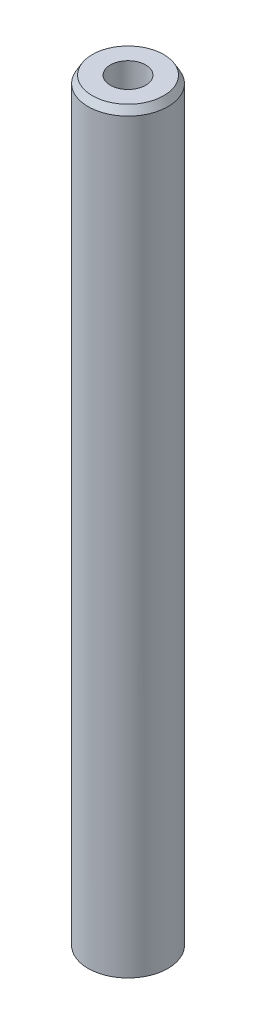
ISO-10303-21;
HEADER;
FILE_DESCRIPTION(('STEP AP214'),'2;1');
FILE_NAME('part.step','',(''),(''),'','','');
FILE_SCHEMA(('AUTOMOTIVE_DESIGN { 1 0 10303 214 1 1 1 1 }'));
ENDSEC;
DATA;
#1=APPLICATION_CONTEXT('core data for automotive mechanical design processes');
#2=APPLICATION_PROTOCOL_DEFINITION('international standard','automotive_design',2000,#1);
#3=PRODUCT_CONTEXT('',#1,'mechanical');
#4=PRODUCT('Part','Part','',(#3));
#5=PRODUCT_RELATED_PRODUCT_CATEGORY('part','',(#4));
#6=PRODUCT_DEFINITION_FORMATION('','',#4);
#7=PRODUCT_DEFINITION_CONTEXT('part definition',#1,'design');
#8=PRODUCT_DEFINITION('design','',#6,#7);
#9=PRODUCT_DEFINITION_SHAPE('','',#8);
#10=(LENGTH_UNIT() NAMED_UNIT(*) SI_UNIT(.MILLI.,.METRE.));
#11=(NAMED_UNIT(*) PLANE_ANGLE_UNIT() SI_UNIT($,.RADIAN.));
#12=(NAMED_UNIT(*) SI_UNIT($,.STERADIAN.) SOLID_ANGLE_UNIT());
#13=UNCERTAINTY_MEASURE_WITH_UNIT(LENGTH_MEASURE(1.E-05),#10,'distance_accuracy_value','');
#14=(GEOMETRIC_REPRESENTATION_CONTEXT(3) GLOBAL_UNCERTAINTY_ASSIGNED_CONTEXT((#13)) GLOBAL_UNIT_ASSIGNED_CONTEXT((#10,
#11,#12)) REPRESENTATION_CONTEXT('',''));
#15=CARTESIAN_POINT('',(0.,0.,0.));
#16=DIRECTION('',(0.,0.,1.));
#17=DIRECTION('',(1.,0.,0.));
#18=AXIS2_PLACEMENT_3D('',#15,#16,#17);
#19=CARTESIAN_POINT('',(0.,474.528961845361,0.));
#20=DIRECTION('',(0.,-1.,0.));
#21=DIRECTION('',(0.,0.,-1.));
#22=AXIS2_PLACEMENT_3D('',#19,#20,#21);
#23=CYLINDRICAL_SURFACE('',#22,25.);
#24=CARTESIAN_POINT('',(0.,469.940287859123,0.));
#25=DIRECTION('',(0.,1.,0.));
#26=DIRECTION('',(0.,0.,1.));
#27=AXIS2_PLACEMENT_3D('',#24,#25,#26);
#28=CIRCLE('',#27,25.);
#29=CARTESIAN_POINT('',(0.,469.940287859123,-25.));
#30=VERTEX_POINT('',#29);
#31=EDGE_CURVE('E50',#30,#30,#28,.F.);
#32=CARTESIAN_POINT('',(0.,2.64927216117855,0.));
#33=DIRECTION('',(0.,1.,0.));
#34=DIRECTION('',(0.,0.,1.));
#35=AXIS2_PLACEMENT_3D('',#32,#33,#34);
#36=CIRCLE('',#35,25.);
#37=CARTESIAN_POINT('',(0.,2.64927216117855,-25.));
#38=VERTEX_POINT('',#37);
#39=EDGE_CURVE('E51',#38,#38,#36,.T.);
#40=CARTESIAN_POINT('',(0.,469.940287859123,-25.));
#41=CARTESIAN_POINT('',(0.,465.072673112269,-25.));
#42=CARTESIAN_POINT('',(0.,460.205058365416,-25.));
#43=CARTESIAN_POINT('',(0.,450.469828871709,-25.));
#44=CARTESIAN_POINT('',(0.,445.602214124855,-25.));
#45=CARTESIAN_POINT('',(0.,435.866984631148,-25.));
#46=CARTESIAN_POINT('',(0.,430.999369884294,-25.));
#47=CARTESIAN_POINT('',(0.,421.264140390587,-25.));
#48=CARTESIAN_POINT('',(0.,416.396525643734,-25.));
#49=CARTESIAN_POINT('',(0.,406.661296150026,-25.));
#50=CARTESIAN_POINT('',(0.,401.793681403173,-25.));
#51=CARTESIAN_POINT('',(0.,392.058451909466,-25.));
#52=CARTESIAN_POINT('',(0.,387.190837162612,-25.));
#53=CARTESIAN_POINT('',(0.,377.455607668905,-25.));
#54=CARTESIAN_POINT('',(0.,372.587992922051,-25.));
#55=CARTESIAN_POINT('',(0.,362.852763428344,-25.));
#56=CARTESIAN_POINT('',(0.,357.985148681491,-25.));
#57=CARTESIAN_POINT('',(0.,348.249919187783,-25.));
#58=CARTESIAN_POINT('',(0.,343.38230444093,-25.));
#59=CARTESIAN_POINT('',(0.,333.647074947223,-25.));
#60=CARTESIAN_POINT('',(0.,328.779460200369,-25.));
#61=CARTESIAN_POINT('',(0.,319.044230706662,-25.));
#62=CARTESIAN_POINT('',(0.,314.176615959808,-25.));
#63=CARTESIAN_POINT('',(0.,304.441386466101,-25.));
#64=CARTESIAN_POINT('',(0.,299.573771719247,-25.));
#65=CARTESIAN_POINT('',(0.,289.83854222554,-25.));
#66=CARTESIAN_POINT('',(0.,284.970927478687,-25.));
#67=CARTESIAN_POINT('',(0.,275.235697984979,-25.));
#68=CARTESIAN_POINT('',(0.,270.368083238126,-25.));
#69=CARTESIAN_POINT('',(0.,260.632853744419,-25.));
#70=CARTESIAN_POINT('',(0.,255.765238997565,-25.));
#71=CARTESIAN_POINT('',(0.,246.030009503858,-25.));
#72=CARTESIAN_POINT('',(0.,241.162394757004,-25.));
#73=CARTESIAN_POINT('',(0.,231.427165263297,-25.));
#74=CARTESIAN_POINT('',(0.,226.559550516444,-25.));
#75=CARTESIAN_POINT('',(0.,216.824321022736,-25.));
#76=CARTESIAN_POINT('',(0.,211.956706275883,-25.));
#77=CARTESIAN_POINT('',(0.,202.221476782176,-25.));
#78=CARTESIAN_POINT('',(0.,197.353862035322,-25.));
#79=CARTESIAN_POINT('',(0.,187.618632541615,-25.));
#80=CARTESIAN_POINT('',(0.,182.751017794761,-25.));
#81=CARTESIAN_POINT('',(0.,173.015788301054,-25.));
#82=CARTESIAN_POINT('',(0.,168.148173554201,-25.));
#83=CARTESIAN_POINT('',(0.,158.412944060493,-25.));
#84=CARTESIAN_POINT('',(0.,153.54532931364,-25.));
#85=CARTESIAN_POINT('',(0.,143.810099819933,-25.));
#86=CARTESIAN_POINT('',(0.,138.942485073079,-25.));
#87=CARTESIAN_POINT('',(0.,129.207255579372,-25.));
#88=CARTESIAN_POINT('',(0.,124.339640832518,-25.));
#89=CARTESIAN_POINT('',(0.,114.604411338811,-25.));
#90=CARTESIAN_POINT('',(0.,109.736796591958,-25.));
#91=CARTESIAN_POINT('',(0.,100.00156709825,-25.));
#92=CARTESIAN_POINT('',(0.,95.1339523513968,-25.));
#93=CARTESIAN_POINT('',(0.,85.3987228576896,-25.));
#94=CARTESIAN_POINT('',(0.,80.531108110836,-25.));
#95=CARTESIAN_POINT('',(0.,70.7958786171288,-25.));
#96=CARTESIAN_POINT('',(0.,65.9282638702752,-25.));
#97=CARTESIAN_POINT('',(0.,56.193034376568,-25.));
#98=CARTESIAN_POINT('',(0.,51.3254196297144,-25.));
#99=CARTESIAN_POINT('',(0.,41.5901901360073,-25.));
#100=CARTESIAN_POINT('',(0.,36.7225753891537,-25.));
#101=CARTESIAN_POINT('',(0.,26.9873458954465,-25.));
#102=CARTESIAN_POINT('',(0.,22.1197311485929,-25.));
#103=CARTESIAN_POINT('',(0.,12.3845016548857,-25.));
#104=CARTESIAN_POINT('',(0.,7.51688690803215,-25.));
#105=CARTESIAN_POINT('',(0.,2.64927216117855,-25.));
#106=B_SPLINE_CURVE_WITH_KNOTS('',3,(#40,#41,#42,#43,#44,#45,#46,#47,#48,#49,#50,#51,#52,#53,
#54,#55,#56,#57,#58,#59,#60,#61,#62,#63,#64,#65,#66,#67,#68,#69,#70,#71,#72,#73,#74,#75,#76,#77,
#78,#79,#80,#81,#82,#83,#84,#85,#86,#87,#88,#89,#90,#91,#92,#93,#94,#95,#96,#97,#98,#99,#100,
#101,#102,#103,#104,#105),.UNSPECIFIED.,.F.,.F.,(4,2,2,2,2,2,2,2,2,2,2,2,2,2,2,2,2,2,2,2,2,2,2,
2,2,2,2,2,2,2,2,2,4),(0.,14.6028442405608,29.2056884811215,43.8085327216823,58.4113769622431,
73.0142212028038,87.6170654433646,102.219909683925,116.822753924486,131.425598165047,
146.028442405608,160.631286646168,175.234130886729,189.83697512729,204.439819367851,
219.042663608411,233.645507848972,248.248352089533,262.851196330094,277.454040570654,
292.056884811215,306.659729051776,321.262573292337,335.865417532898,350.468261773458,
365.071106014019,379.67395025458,394.276794495141,408.879638735701,423.482482976262,
438.085327216823,452.688171457384,467.291015697944),.UNSPECIFIED.);
#107=EDGE_CURVE('BSEAM39',#30,#38,#106,.T.);
#108=ORIENTED_EDGE('',*,*,#31,.T.);
#109=ORIENTED_EDGE('',*,*,#39,.T.);
#110=ORIENTED_EDGE('',*,*,#107,.T.);
#111=ORIENTED_EDGE('',*,*,#107,.F.);
#112=EDGE_LOOP('',(#108,#110,#109,#111));
#113=FACE_BOUND('',#112,.T.);
#114=ADVANCED_FACE('F39',(#113),#23,.T.);
#115=CARTESIAN_POINT('',(0.,474.528961845361,0.));
#116=DIRECTION('',(0.,1.,0.));
#117=DIRECTION('',(0.,0.,1.));
#118=AXIS2_PLACEMENT_3D('',#115,#116,#117);
#119=PLANE('',#118);
#120=CARTESIAN_POINT('',(0.,474.528961845361,0.));
#121=DIRECTION('',(0.,1.,0.));
#122=DIRECTION('',(0.,0.,1.));
#123=AXIS2_PLACEMENT_3D('',#120,#121,#122);
#124=CIRCLE('',#123,22.3507278388219);
#125=CARTESIAN_POINT('',(0.,474.528961845361,22.3507278388219));
#126=VERTEX_POINT('',#125);
#127=EDGE_CURVE('E54',#126,#126,#124,.T.);
#128=ORIENTED_EDGE('',*,*,#127,.T.);
#129=EDGE_LOOP('',(#128));
#130=FACE_BOUND('',#129,.T.);
#131=CARTESIAN_POINT('',(0.,474.528961845361,0.));
#132=DIRECTION('',(0.,1.,0.));
#133=DIRECTION('',(0.,0.,1.));
#134=AXIS2_PLACEMENT_3D('',#131,#132,#133);
#135=CIRCLE('',#134,11.0522564921189);
#136=CARTESIAN_POINT('',(0.,474.528961845361,-11.0522564921189));
#137=VERTEX_POINT('',#136);
#138=EDGE_CURVE('E58',#137,#137,#135,.T.);
#139=ORIENTED_EDGE('',*,*,#138,.F.);
#140=EDGE_LOOP('',(#139));
#141=FACE_BOUND('',#140,.T.);
#142=ADVANCED_FACE('F69',(#130,#141),#119,.T.);
#143=CARTESIAN_POINT('',(0.,0.,0.));
#144=DIRECTION('',(0.,1.,0.));
#145=DIRECTION('',(0.,0.,1.));
#146=AXIS2_PLACEMENT_3D('',#143,#144,#145);
#147=PLANE('',#146);
#148=CARTESIAN_POINT('',(0.,0.,0.));
#149=DIRECTION('',(0.,1.,0.));
#150=DIRECTION('',(0.,0.,1.));
#151=AXIS2_PLACEMENT_3D('',#148,#149,#150);
#152=CIRCLE('',#151,20.4113260137609);
#153=CARTESIAN_POINT('',(0.,0.,20.4113260137609));
#154=VERTEX_POINT('',#153);
#155=EDGE_CURVE('E10',#154,#154,#152,.F.);
#156=ORIENTED_EDGE('',*,*,#155,.T.);
#157=EDGE_LOOP('',(#156));
#158=FACE_BOUND('',#157,.T.);
#159=CARTESIAN_POINT('',(0.,0.,0.));
#160=DIRECTION('',(0.,1.,0.));
#161=DIRECTION('',(0.,0.,1.));
#162=AXIS2_PLACEMENT_3D('',#159,#160,#161);
#163=CIRCLE('',#162,11.0522564921189);
#164=CARTESIAN_POINT('',(0.,0.,-11.0522564921189));
#165=VERTEX_POINT('',#164);
#166=EDGE_CURVE('E63',#165,#165,#163,.T.);
#167=ORIENTED_EDGE('',*,*,#166,.T.);
#168=EDGE_LOOP('',(#167));
#169=FACE_BOUND('',#168,.T.);
#170=ADVANCED_FACE('F75',(#158,#169),#147,.F.);
#171=CARTESIAN_POINT('',(0.,474.528961845361,0.));
#172=DIRECTION('',(0.,-1.,0.));
#173=DIRECTION('',(0.,0.,-1.));
#174=AXIS2_PLACEMENT_3D('',#171,#172,#173);
#175=CYLINDRICAL_SURFACE('',#174,11.0522564921189);
#176=CARTESIAN_POINT('',(0.,474.528961845361,-11.0522564921189));
#177=CARTESIAN_POINT('',(0.,469.585951826139,-11.0522564921189));
#178=CARTESIAN_POINT('',(0.,464.642941806916,-11.0522564921189));
#179=CARTESIAN_POINT('',(0.,454.756921768471,-11.0522564921189));
#180=CARTESIAN_POINT('',(0.,449.813911749249,-11.0522564921189));
#181=CARTESIAN_POINT('',(0.,439.927891710804,-11.0522564921189));
#182=CARTESIAN_POINT('',(0.,434.984881691581,-11.0522564921189));
#183=CARTESIAN_POINT('',(0.,425.098861653136,-11.0522564921189));
#184=CARTESIAN_POINT('',(0.,420.155851633914,-11.0522564921189));
#185=CARTESIAN_POINT('',(0.,410.269831595469,-11.0522564921189));
#186=CARTESIAN_POINT('',(0.,405.326821576246,-11.0522564921189));
#187=CARTESIAN_POINT('',(0.,395.440801537801,-11.0522564921189));
#188=CARTESIAN_POINT('',(0.,390.497791518579,-11.0522564921189));
#189=CARTESIAN_POINT('',(0.,380.611771480134,-11.0522564921189));
#190=CARTESIAN_POINT('',(0.,375.668761460911,-11.0522564921189));
#191=CARTESIAN_POINT('',(0.,365.782741422466,-11.0522564921189));
#192=CARTESIAN_POINT('',(0.,360.839731403243,-11.0522564921189));
#193=CARTESIAN_POINT('',(0.,350.953711364798,-11.0522564921189));
#194=CARTESIAN_POINT('',(0.,346.010701345576,-11.0522564921189));
#195=CARTESIAN_POINT('',(0.,336.124681307131,-11.0522564921189));
#196=CARTESIAN_POINT('',(0.,331.181671287908,-11.0522564921189));
#197=CARTESIAN_POINT('',(0.,321.295651249463,-11.0522564921189));
#198=CARTESIAN_POINT('',(0.,316.352641230241,-11.0522564921189));
#199=CARTESIAN_POINT('',(0.,306.466621191796,-11.0522564921189));
#200=CARTESIAN_POINT('',(0.,301.523611172573,-11.0522564921189));
#201=CARTESIAN_POINT('',(0.,291.637591134128,-11.0522564921189));
#202=CARTESIAN_POINT('',(0.,286.694581114906,-11.0522564921189));
#203=CARTESIAN_POINT('',(0.,276.808561076461,-11.0522564921189));
#204=CARTESIAN_POINT('',(0.,271.865551057238,-11.0522564921189));
#205=CARTESIAN_POINT('',(0.,261.979531018793,-11.0522564921189));
#206=CARTESIAN_POINT('',(0.,257.036520999571,-11.0522564921189));
#207=CARTESIAN_POINT('',(0.,247.150500961126,-11.0522564921189));
#208=CARTESIAN_POINT('',(0.,242.207490941903,-11.0522564921189));
#209=CARTESIAN_POINT('',(0.,232.321470903458,-11.0522564921189));
#210=CARTESIAN_POINT('',(0.,227.378460884236,-11.0522564921189));
#211=CARTESIAN_POINT('',(0.,217.492440845791,-11.0522564921189));
#212=CARTESIAN_POINT('',(0.,212.549430826568,-11.0522564921189));
#213=CARTESIAN_POINT('',(0.,202.663410788123,-11.0522564921189));
#214=CARTESIAN_POINT('',(0.,197.720400768901,-11.0522564921189));
#215=CARTESIAN_POINT('',(0.,187.834380730456,-11.0522564921189));
#216=CARTESIAN_POINT('',(0.,182.891370711233,-11.0522564921189));
#217=CARTESIAN_POINT('',(0.,173.005350672788,-11.0522564921189));
#218=CARTESIAN_POINT('',(0.,168.062340653565,-11.0522564921189));
#219=CARTESIAN_POINT('',(0.,158.17632061512,-11.0522564921189));
#220=CARTESIAN_POINT('',(0.,153.233310595898,-11.0522564921189));
#221=CARTESIAN_POINT('',(0.,143.347290557453,-11.0522564921189));
#222=CARTESIAN_POINT('',(0.,138.40428053823,-11.0522564921189));
#223=CARTESIAN_POINT('',(0.,128.518260499785,-11.0522564921189));
#224=CARTESIAN_POINT('',(0.,123.575250480563,-11.0522564921189));
#225=CARTESIAN_POINT('',(0.,113.689230442118,-11.0522564921189));
#226=CARTESIAN_POINT('',(0.,108.746220422895,-11.0522564921189));
#227=CARTESIAN_POINT('',(0.,98.8602003844502,-11.0522564921189));
#228=CARTESIAN_POINT('',(0.,93.9171903652277,-11.0522564921189));
#229=CARTESIAN_POINT('',(0.,84.0311703267827,-11.0522564921189));
#230=CARTESIAN_POINT('',(0.,79.0881603075602,-11.0522564921189));
#231=CARTESIAN_POINT('',(0.,69.2021402691152,-11.0522564921189));
#232=CARTESIAN_POINT('',(0.,64.2591302498926,-11.0522564921189));
#233=CARTESIAN_POINT('',(0.,54.3731102114476,-11.0522564921189));
#234=CARTESIAN_POINT('',(0.,49.4301001922251,-11.0522564921189));
#235=CARTESIAN_POINT('',(0.,39.5440801537801,-11.0522564921189));
#236=CARTESIAN_POINT('',(0.,34.6010701345576,-11.0522564921189));
#237=CARTESIAN_POINT('',(0.,24.7150500961125,-11.0522564921189));
#238=CARTESIAN_POINT('',(0.,19.77204007689,-11.0522564921189));
#239=CARTESIAN_POINT('',(0.,9.88602003844499,-11.0522564921189));
#240=CARTESIAN_POINT('',(0.,4.94301001922247,-11.0522564921189));
#241=CARTESIAN_POINT('',(0.,0.,-11.0522564921189));
#242=B_SPLINE_CURVE_WITH_KNOTS('',3,(#176,#177,#178,#179,#180,#181,#182,#183,#184,#185,#186,
#187,#188,#189,#190,#191,#192,#193,#194,#195,#196,#197,#198,#199,#200,#201,#202,#203,#204,#205,
#206,#207,#208,#209,#210,#211,#212,#213,#214,#215,#216,#217,#218,#219,#220,#221,#222,#223,#224,
#225,#226,#227,#228,#229,#230,#231,#232,#233,#234,#235,#236,#237,#238,#239,#240,#241),
.UNSPECIFIED.,.F.,.F.,(4,2,2,2,2,2,2,2,2,2,2,2,2,2,2,2,2,2,2,2,2,2,2,2,2,2,2,2,2,2,2,2,4),(0.,
14.8290300576676,29.6580601153351,44.4870901730027,59.3161202306702,74.1451502883377,
88.9741803460053,103.803210403673,118.63224046134,133.461270519008,148.290300576675,
163.119330634343,177.948360692011,192.777390749678,207.606420807346,222.435450865013,
237.264480922681,252.093510980348,266.922541038016,281.751571095683,296.580601153351,
311.409631211018,326.238661268686,341.067691326353,355.896721384021,370.725751441689,
385.554781499356,400.383811557024,415.212841614691,430.041871672359,444.870901730026,
459.699931787694,474.528961845361),.UNSPECIFIED.);
#243=EDGE_CURVE('BSEAM70',#137,#165,#242,.T.);
#244=ORIENTED_EDGE('',*,*,#138,.T.);
#245=ORIENTED_EDGE('',*,*,#166,.F.);
#246=ORIENTED_EDGE('',*,*,#243,.T.);
#247=ORIENTED_EDGE('',*,*,#243,.F.);
#248=EDGE_LOOP('',(#244,#246,#245,#247));
#249=FACE_BOUND('',#248,.T.);
#250=ADVANCED_FACE('F70',(#249),#175,.F.);
#251=CARTESIAN_POINT('',(0.,474.528961845361,0.));
#252=DIRECTION('',(0.,-1.,0.));
#253=DIRECTION('',(0.,0.,-1.));
#254=AXIS2_PLACEMENT_3D('',#251,#252,#253);
#255=CONICAL_SURFACE('',#254,22.3507278388219,0.5235987755983);
#256=ORIENTED_EDGE('',*,*,#31,.F.);
#257=EDGE_LOOP('',(#256));
#258=FACE_BOUND('',#257,.T.);
#259=ORIENTED_EDGE('',*,*,#127,.F.);
#260=EDGE_LOOP('',(#259));
#261=FACE_BOUND('',#260,.T.);
#262=ADVANCED_FACE('F81',(#258,#261),#255,.T.);
#263=CARTESIAN_POINT('',(0.,2.64927216117855,0.));
#264=DIRECTION('',(0.,1.,0.));
#265=DIRECTION('',(0.,0.,1.));
#266=AXIS2_PLACEMENT_3D('',#263,#264,#265);
#267=CONICAL_SURFACE('',#266,25.,1.0471975511966);
#268=ORIENTED_EDGE('',*,*,#155,.F.);
#269=EDGE_LOOP('',(#268));
#270=FACE_BOUND('',#269,.T.);
#271=ORIENTED_EDGE('',*,*,#39,.F.);
#272=EDGE_LOOP('',(#271));
#273=FACE_BOUND('',#272,.T.);
#274=ADVANCED_FACE('F45',(#270,#273),#267,.T.);
#275=CLOSED_SHELL('',(#114,#142,#170,#250,#262,#274));
#276=MANIFOLD_SOLID_BREP('B2',#275);
#277=ADVANCED_BREP_SHAPE_REPRESENTATION('',(#18,#276),#14);
#278=SHAPE_DEFINITION_REPRESENTATION(#9,#277);
ENDSEC;
END-ISO-10303-21;
